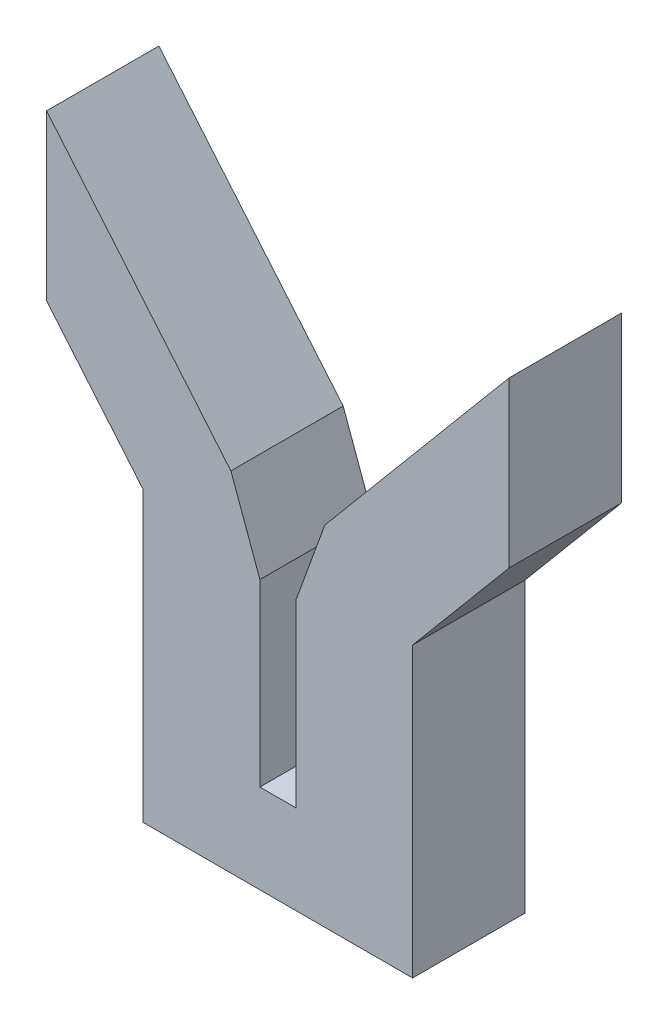
ISO-10303-21;
HEADER;
FILE_DESCRIPTION(('STEP AP214'),'2;1');
FILE_NAME('part.step','',(''),(''),'','','');
FILE_SCHEMA(('AUTOMOTIVE_DESIGN { 1 0 10303 214 1 1 1 1 }'));
ENDSEC;
DATA;
#1=APPLICATION_CONTEXT('core data for automotive mechanical design processes');
#2=APPLICATION_PROTOCOL_DEFINITION('international standard','automotive_design',2000,#1);
#3=PRODUCT_CONTEXT('',#1,'mechanical');
#4=PRODUCT('Part','Part','',(#3));
#5=PRODUCT_RELATED_PRODUCT_CATEGORY('part','',(#4));
#6=PRODUCT_DEFINITION_FORMATION('','',#4);
#7=PRODUCT_DEFINITION_CONTEXT('part definition',#1,'design');
#8=PRODUCT_DEFINITION('design','',#6,#7);
#9=PRODUCT_DEFINITION_SHAPE('','',#8);
#10=(LENGTH_UNIT() NAMED_UNIT(*) SI_UNIT(.MILLI.,.METRE.));
#11=(NAMED_UNIT(*) PLANE_ANGLE_UNIT() SI_UNIT($,.RADIAN.));
#12=(NAMED_UNIT(*) SI_UNIT($,.STERADIAN.) SOLID_ANGLE_UNIT());
#13=UNCERTAINTY_MEASURE_WITH_UNIT(LENGTH_MEASURE(1.E-05),#10,'distance_accuracy_value','');
#14=(GEOMETRIC_REPRESENTATION_CONTEXT(3) GLOBAL_UNCERTAINTY_ASSIGNED_CONTEXT((#13)) GLOBAL_UNIT_ASSIGNED_CONTEXT((#10,
#11,#12)) REPRESENTATION_CONTEXT('',''));
#15=CARTESIAN_POINT('',(0.,0.,0.));
#16=DIRECTION('',(0.,0.,1.));
#17=DIRECTION('',(1.,0.,0.));
#18=AXIS2_PLACEMENT_3D('',#15,#16,#17);
#19=CARTESIAN_POINT('',(15.,0.,12.5));
#20=DIRECTION('',(1.,0.,0.));
#21=DIRECTION('',(0.,0.,-1.));
#22=AXIS2_PLACEMENT_3D('',#19,#20,#21);
#23=PLANE('',#22);
#24=DIRECTION('',(0.,-1.,0.));
#25=VECTOR('',#24,1.);
#26=CARTESIAN_POINT('',(15.,0.,0.));
#27=LINE('',#26,#25);
#28=CARTESIAN_POINT('',(15.,32.1026160659914,0.));
#29=VERTEX_POINT('',#28);
#30=CARTESIAN_POINT('',(15.,0.,0.));
#31=VERTEX_POINT('',#30);
#32=EDGE_CURVE('E161',#29,#31,#27,.T.);
#33=ORIENTED_EDGE('',*,*,#32,.F.);
#34=DIRECTION('',(0.,0.,-1.));
#35=VECTOR('',#34,1.);
#36=CARTESIAN_POINT('',(15.,32.1026160659914,12.5));
#37=LINE('',#36,#35);
#38=CARTESIAN_POINT('',(15.,32.1026160659914,12.5));
#39=VERTEX_POINT('',#38);
#40=EDGE_CURVE('E11',#39,#29,#37,.T.);
#41=ORIENTED_EDGE('',*,*,#40,.F.);
#42=DIRECTION('',(0.,-1.,0.));
#43=VECTOR('',#42,1.);
#44=CARTESIAN_POINT('',(15.,0.,12.5));
#45=LINE('',#44,#43);
#46=CARTESIAN_POINT('',(15.,0.,12.5));
#47=VERTEX_POINT('',#46);
#48=EDGE_CURVE('E194',#39,#47,#45,.T.);
#49=ORIENTED_EDGE('',*,*,#48,.T.);
#50=DIRECTION('',(0.,0.,-1.));
#51=VECTOR('',#50,1.);
#52=CARTESIAN_POINT('',(15.,0.,12.5));
#53=LINE('',#52,#51);
#54=EDGE_CURVE('E102',#47,#31,#53,.T.);
#55=ORIENTED_EDGE('',*,*,#54,.T.);
#56=EDGE_LOOP('',(#33,#41,#49,#55));
#57=FACE_BOUND('',#56,.T.);
#58=ADVANCED_FACE('F33',(#57),#23,.T.);
#59=CARTESIAN_POINT('',(-7.00509126437934,5.87796949630391,12.5));
#60=DIRECTION('',(0.766044443118977,-0.64278760968654,0.));
#61=DIRECTION('',(0.64278760968654,0.766044443118977,0.));
#62=AXIS2_PLACEMENT_3D('',#59,#60,#61);
#63=PLANE('',#62);
#64=DIRECTION('',(-0.64278760968654,-0.766044443118977,0.));
#65=VECTOR('',#64,1.);
#66=CARTESIAN_POINT('',(-7.00509126437934,5.87796949630391,0.));
#67=LINE('',#66,#65);
#68=CARTESIAN_POINT('',(25.7454388794693,44.9085314546003,0.));
#69=VERTEX_POINT('',#68);
#70=EDGE_CURVE('E164',#69,#29,#67,.T.);
#71=ORIENTED_EDGE('',*,*,#70,.F.);
#72=DIRECTION('',(0.,0.,-1.));
#73=VECTOR('',#72,1.);
#74=CARTESIAN_POINT('',(25.7454388794693,44.9085314546003,12.5));
#75=LINE('',#74,#73);
#76=CARTESIAN_POINT('',(25.7454388794693,44.9085314546003,12.5));
#77=VERTEX_POINT('',#76);
#78=EDGE_CURVE('E41',#77,#69,#75,.T.);
#79=ORIENTED_EDGE('',*,*,#78,.F.);
#80=DIRECTION('',(-0.64278760968654,-0.766044443118977,0.));
#81=VECTOR('',#80,1.);
#82=CARTESIAN_POINT('',(-7.00509126437934,5.87796949630391,12.5));
#83=LINE('',#82,#81);
#84=EDGE_CURVE('E239',#77,#39,#83,.T.);
#85=ORIENTED_EDGE('',*,*,#84,.T.);
#86=ORIENTED_EDGE('',*,*,#40,.T.);
#87=EDGE_LOOP('',(#71,#79,#85,#86));
#88=FACE_BOUND('',#87,.T.);
#89=ADVANCED_FACE('F226',(#88),#63,.T.);
#90=CARTESIAN_POINT('',(25.7454388794693,0.,12.5));
#91=DIRECTION('',(1.,0.,0.));
#92=DIRECTION('',(0.,1.,0.));
#93=AXIS2_PLACEMENT_3D('',#90,#91,#92);
#94=PLANE('',#93);
#95=DIRECTION('',(0.,-1.,0.));
#96=VECTOR('',#95,1.);
#97=CARTESIAN_POINT('',(25.7454388794693,0.,0.));
#98=LINE('',#97,#96);
#99=CARTESIAN_POINT('',(25.7454388794693,63.2289091694793,0.));
#100=VERTEX_POINT('',#99);
#101=EDGE_CURVE('E167',#100,#69,#98,.T.);
#102=ORIENTED_EDGE('',*,*,#101,.F.);
#103=DIRECTION('',(0.,0.,-1.));
#104=VECTOR('',#103,1.);
#105=CARTESIAN_POINT('',(25.7454388794693,63.2289091694793,12.5));
#106=LINE('',#105,#104);
#107=CARTESIAN_POINT('',(25.7454388794693,63.2289091694793,12.5));
#108=VERTEX_POINT('',#107);
#109=EDGE_CURVE('E215',#108,#100,#106,.T.);
#110=ORIENTED_EDGE('',*,*,#109,.F.);
#111=DIRECTION('',(0.,-1.,0.));
#112=VECTOR('',#111,1.);
#113=CARTESIAN_POINT('',(25.7454388794693,0.,12.5));
#114=LINE('',#113,#112);
#115=EDGE_CURVE('E222',#108,#77,#114,.T.);
#116=ORIENTED_EDGE('',*,*,#115,.T.);
#117=ORIENTED_EDGE('',*,*,#78,.T.);
#118=EDGE_LOOP('',(#102,#110,#116,#117));
#119=FACE_BOUND('',#118,.T.);
#120=ADVANCED_FACE('F220',(#119),#94,.T.);
#121=CARTESIAN_POINT('',(-16.0261162702418,13.4475082515641,12.5));
#122=DIRECTION('',(-0.766044443118977,0.642787609686541,0.));
#123=DIRECTION('',(-0.642787609686541,-0.766044443118977,0.));
#124=AXIS2_PLACEMENT_3D('',#121,#122,#123);
#125=PLANE('',#124);
#126=DIRECTION('',(0.642787609686541,0.766044443118977,0.));
#127=VECTOR('',#126,1.);
#128=CARTESIAN_POINT('',(-16.0261162702418,13.4475082515641,0.));
#129=LINE('',#128,#127);
#130=CARTESIAN_POINT('',(5.22752196876619,38.7766079785995,0.));
#131=VERTEX_POINT('',#130);
#132=EDGE_CURVE('E170',#131,#100,#129,.T.);
#133=ORIENTED_EDGE('',*,*,#132,.F.);
#134=DIRECTION('',(0.,0.,-1.));
#135=VECTOR('',#134,1.);
#136=CARTESIAN_POINT('',(5.22752196876619,38.7766079785995,12.5));
#137=LINE('',#136,#135);
#138=CARTESIAN_POINT('',(5.22752196876619,38.7766079785995,12.5));
#139=VERTEX_POINT('',#138);
#140=EDGE_CURVE('E213',#139,#131,#137,.T.);
#141=ORIENTED_EDGE('',*,*,#140,.F.);
#142=DIRECTION('',(0.642787609686541,0.766044443118977,0.));
#143=VECTOR('',#142,1.);
#144=CARTESIAN_POINT('',(-16.0261162702418,13.4475082515641,12.5));
#145=LINE('',#144,#143);
#146=EDGE_CURVE('E236',#139,#108,#145,.T.);
#147=ORIENTED_EDGE('',*,*,#146,.T.);
#148=ORIENTED_EDGE('',*,*,#109,.T.);
#149=EDGE_LOOP('',(#133,#141,#147,#148));
#150=FACE_BOUND('',#149,.T.);
#151=ADVANCED_FACE('F233',(#150),#125,.T.);
#152=CARTESIAN_POINT('',(-7.84654351504704,2.85590828135163,12.5));
#153=DIRECTION('',(-0.939692620785908,0.34202014332567,0.));
#154=DIRECTION('',(-0.34202014332567,-0.939692620785908,0.));
#155=AXIS2_PLACEMENT_3D('',#152,#153,#154);
#156=PLANE('',#155);
#157=DIRECTION('',(0.34202014332567,0.939692620785908,0.));
#158=VECTOR('',#157,1.);
#159=CARTESIAN_POINT('',(-7.84654351504704,2.85590828135163,0.));
#160=LINE('',#159,#158);
#161=CARTESIAN_POINT('',(2.,29.9090642486206,0.));
#162=VERTEX_POINT('',#161);
#163=EDGE_CURVE('E173',#162,#131,#160,.T.);
#164=ORIENTED_EDGE('',*,*,#163,.F.);
#165=DIRECTION('',(0.,0.,-1.));
#166=VECTOR('',#165,1.);
#167=CARTESIAN_POINT('',(2.,29.9090642486206,12.5));
#168=LINE('',#167,#166);
#169=CARTESIAN_POINT('',(2.,29.9090642486206,12.5));
#170=VERTEX_POINT('',#169);
#171=EDGE_CURVE('E211',#170,#162,#168,.T.);
#172=ORIENTED_EDGE('',*,*,#171,.F.);
#173=DIRECTION('',(0.34202014332567,0.939692620785908,0.));
#174=VECTOR('',#173,1.);
#175=CARTESIAN_POINT('',(-7.84654351504704,2.85590828135163,12.5));
#176=LINE('',#175,#174);
#177=EDGE_CURVE('E241',#170,#139,#176,.T.);
#178=ORIENTED_EDGE('',*,*,#177,.T.);
#179=ORIENTED_EDGE('',*,*,#140,.T.);
#180=EDGE_LOOP('',(#164,#172,#178,#179));
#181=FACE_BOUND('',#180,.T.);
#182=ADVANCED_FACE('F282',(#181),#156,.T.);
#183=CARTESIAN_POINT('',(2.,0.,12.5));
#184=DIRECTION('',(1.,0.,0.));
#185=DIRECTION('',(0.,1.,0.));
#186=AXIS2_PLACEMENT_3D('',#183,#184,#185);
#187=PLANE('',#186);
#188=DIRECTION('',(0.,-1.,0.));
#189=VECTOR('',#188,1.);
#190=CARTESIAN_POINT('',(2.,0.,0.));
#191=LINE('',#190,#189);
#192=CARTESIAN_POINT('',(2.,9.90906424862065,0.));
#193=VERTEX_POINT('',#192);
#194=EDGE_CURVE('E176',#162,#193,#191,.T.);
#195=ORIENTED_EDGE('',*,*,#194,.T.);
#196=DIRECTION('',(0.,0.,-1.));
#197=VECTOR('',#196,1.);
#198=CARTESIAN_POINT('',(2.,9.90906424862065,12.5));
#199=LINE('',#198,#197);
#200=CARTESIAN_POINT('',(2.,9.90906424862065,12.5));
#201=VERTEX_POINT('',#200);
#202=EDGE_CURVE('E208',#201,#193,#199,.T.);
#203=ORIENTED_EDGE('',*,*,#202,.F.);
#204=DIRECTION('',(0.,-1.,0.));
#205=VECTOR('',#204,1.);
#206=CARTESIAN_POINT('',(2.,0.,12.5));
#207=LINE('',#206,#205);
#208=EDGE_CURVE('E247',#170,#201,#207,.T.);
#209=ORIENTED_EDGE('',*,*,#208,.F.);
#210=ORIENTED_EDGE('',*,*,#171,.T.);
#211=EDGE_LOOP('',(#195,#203,#209,#210));
#212=FACE_BOUND('',#211,.T.);
#213=ADVANCED_FACE('F285',(#212),#187,.F.);
#214=CARTESIAN_POINT('',(0.,9.90906424862064,12.5));
#215=DIRECTION('',(0.,-1.,0.));
#216=DIRECTION('',(1.,0.,0.));
#217=AXIS2_PLACEMENT_3D('',#214,#215,#216);
#218=PLANE('',#217);
#219=DIRECTION('',(-1.,0.,0.));
#220=VECTOR('',#219,1.);
#221=CARTESIAN_POINT('',(0.,9.90906424862064,0.));
#222=LINE('',#221,#220);
#223=CARTESIAN_POINT('',(-2.,9.90906424862064,0.));
#224=VERTEX_POINT('',#223);
#225=EDGE_CURVE('E178',#193,#224,#222,.T.);
#226=ORIENTED_EDGE('',*,*,#225,.T.);
#227=DIRECTION('',(0.,0.,-1.));
#228=VECTOR('',#227,1.);
#229=CARTESIAN_POINT('',(-2.,9.90906424862064,12.5));
#230=LINE('',#229,#228);
#231=CARTESIAN_POINT('',(-2.,9.90906424862064,12.5));
#232=VERTEX_POINT('',#231);
#233=EDGE_CURVE('E206',#232,#224,#230,.T.);
#234=ORIENTED_EDGE('',*,*,#233,.F.);
#235=DIRECTION('',(-1.,0.,0.));
#236=VECTOR('',#235,1.);
#237=CARTESIAN_POINT('',(0.,9.90906424862064,12.5));
#238=LINE('',#237,#236);
#239=EDGE_CURVE('E249',#201,#232,#238,.T.);
#240=ORIENTED_EDGE('',*,*,#239,.F.);
#241=ORIENTED_EDGE('',*,*,#202,.T.);
#242=EDGE_LOOP('',(#226,#234,#240,#241));
#243=FACE_BOUND('',#242,.T.);
#244=ADVANCED_FACE('F289',(#243),#218,.F.);
#245=CARTESIAN_POINT('',(-2.,0.,12.5));
#246=DIRECTION('',(1.,0.,0.));
#247=DIRECTION('',(0.,1.,0.));
#248=AXIS2_PLACEMENT_3D('',#245,#246,#247);
#249=PLANE('',#248);
#250=DIRECTION('',(0.,-1.,0.));
#251=VECTOR('',#250,1.);
#252=CARTESIAN_POINT('',(-2.,0.,0.));
#253=LINE('',#252,#251);
#254=CARTESIAN_POINT('',(-2.,29.9090642486206,0.));
#255=VERTEX_POINT('',#254);
#256=EDGE_CURVE('E181',#255,#224,#253,.T.);
#257=ORIENTED_EDGE('',*,*,#256,.F.);
#258=DIRECTION('',(0.,0.,-1.));
#259=VECTOR('',#258,1.);
#260=CARTESIAN_POINT('',(-2.,29.9090642486206,12.5));
#261=LINE('',#260,#259);
#262=CARTESIAN_POINT('',(-2.,29.9090642486206,12.5));
#263=VERTEX_POINT('',#262);
#264=EDGE_CURVE('E204',#263,#255,#261,.T.);
#265=ORIENTED_EDGE('',*,*,#264,.F.);
#266=DIRECTION('',(0.,-1.,0.));
#267=VECTOR('',#266,1.);
#268=CARTESIAN_POINT('',(-2.,0.,12.5));
#269=LINE('',#268,#267);
#270=EDGE_CURVE('E251',#263,#232,#269,.T.);
#271=ORIENTED_EDGE('',*,*,#270,.T.);
#272=ORIENTED_EDGE('',*,*,#233,.T.);
#273=EDGE_LOOP('',(#257,#265,#271,#272));
#274=FACE_BOUND('',#273,.T.);
#275=ADVANCED_FACE('F293',(#274),#249,.T.);
#276=CARTESIAN_POINT('',(7.84654351504705,2.85590828135164,12.5));
#277=DIRECTION('',(-0.939692620785908,-0.34202014332567,0.));
#278=DIRECTION('',(0.34202014332567,-0.939692620785908,0.));
#279=AXIS2_PLACEMENT_3D('',#276,#277,#278);
#280=PLANE('',#279);
#281=DIRECTION('',(-0.34202014332567,0.939692620785908,0.));
#282=VECTOR('',#281,1.);
#283=CARTESIAN_POINT('',(7.84654351504705,2.85590828135164,0.));
#284=LINE('',#283,#282);
#285=CARTESIAN_POINT('',(-5.22752196876618,38.7766079785994,0.));
#286=VERTEX_POINT('',#285);
#287=EDGE_CURVE('E184',#255,#286,#284,.T.);
#288=ORIENTED_EDGE('',*,*,#287,.T.);
#289=DIRECTION('',(0.,0.,-1.));
#290=VECTOR('',#289,1.);
#291=CARTESIAN_POINT('',(-5.22752196876618,38.7766079785994,12.5));
#292=LINE('',#291,#290);
#293=CARTESIAN_POINT('',(-5.22752196876618,38.7766079785994,12.5));
#294=VERTEX_POINT('',#293);
#295=EDGE_CURVE('E201',#294,#286,#292,.T.);
#296=ORIENTED_EDGE('',*,*,#295,.F.);
#297=DIRECTION('',(-0.34202014332567,0.939692620785908,0.));
#298=VECTOR('',#297,1.);
#299=CARTESIAN_POINT('',(7.84654351504705,2.85590828135164,12.5));
#300=LINE('',#299,#298);
#301=EDGE_CURVE('E254',#263,#294,#300,.T.);
#302=ORIENTED_EDGE('',*,*,#301,.F.);
#303=ORIENTED_EDGE('',*,*,#264,.T.);
#304=EDGE_LOOP('',(#288,#296,#302,#303));
#305=FACE_BOUND('',#304,.T.);
#306=ADVANCED_FACE('F297',(#305),#280,.F.);
#307=CARTESIAN_POINT('',(16.0261162702418,13.4475082515641,12.5));
#308=DIRECTION('',(-0.766044443118977,-0.642787609686541,0.));
#309=DIRECTION('',(0.642787609686541,-0.766044443118977,0.));
#310=AXIS2_PLACEMENT_3D('',#307,#308,#309);
#311=PLANE('',#310);
#312=DIRECTION('',(-0.642787609686541,0.766044443118977,0.));
#313=VECTOR('',#312,1.);
#314=CARTESIAN_POINT('',(16.0261162702418,13.4475082515641,0.));
#315=LINE('',#314,#313);
#316=CARTESIAN_POINT('',(-25.7454388794693,63.2289091694792,0.));
#317=VERTEX_POINT('',#316);
#318=EDGE_CURVE('E186',#286,#317,#315,.T.);
#319=ORIENTED_EDGE('',*,*,#318,.T.);
#320=DIRECTION('',(0.,0.,-1.));
#321=VECTOR('',#320,1.);
#322=CARTESIAN_POINT('',(-25.7454388794693,63.2289091694792,12.5));
#323=LINE('',#322,#321);
#324=CARTESIAN_POINT('',(-25.7454388794693,63.2289091694792,12.5));
#325=VERTEX_POINT('',#324);
#326=EDGE_CURVE('E198',#325,#317,#323,.T.);
#327=ORIENTED_EDGE('',*,*,#326,.F.);
#328=DIRECTION('',(-0.642787609686541,0.766044443118977,0.));
#329=VECTOR('',#328,1.);
#330=CARTESIAN_POINT('',(16.0261162702418,13.4475082515641,12.5));
#331=LINE('',#330,#329);
#332=EDGE_CURVE('E256',#294,#325,#331,.T.);
#333=ORIENTED_EDGE('',*,*,#332,.F.);
#334=ORIENTED_EDGE('',*,*,#295,.T.);
#335=EDGE_LOOP('',(#319,#327,#333,#334));
#336=FACE_BOUND('',#335,.T.);
#337=ADVANCED_FACE('F263',(#336),#311,.F.);
#338=CARTESIAN_POINT('',(-25.7454388794693,0.,12.5));
#339=DIRECTION('',(1.,0.,0.));
#340=DIRECTION('',(0.,1.,0.));
#341=AXIS2_PLACEMENT_3D('',#338,#339,#340);
#342=PLANE('',#341);
#343=DIRECTION('',(0.,-1.,0.));
#344=VECTOR('',#343,1.);
#345=CARTESIAN_POINT('',(-25.7454388794693,0.,0.));
#346=LINE('',#345,#344);
#347=CARTESIAN_POINT('',(-25.7454388794693,44.9085314546003,0.));
#348=VERTEX_POINT('',#347);
#349=EDGE_CURVE('E188',#317,#348,#346,.T.);
#350=ORIENTED_EDGE('',*,*,#349,.T.);
#351=DIRECTION('',(0.,0.,-1.));
#352=VECTOR('',#351,1.);
#353=CARTESIAN_POINT('',(-25.7454388794693,44.9085314546003,12.5));
#354=LINE('',#353,#352);
#355=CARTESIAN_POINT('',(-25.7454388794693,44.9085314546003,12.5));
#356=VERTEX_POINT('',#355);
#357=EDGE_CURVE('E153',#356,#348,#354,.T.);
#358=ORIENTED_EDGE('',*,*,#357,.F.);
#359=DIRECTION('',(0.,-1.,0.));
#360=VECTOR('',#359,1.);
#361=CARTESIAN_POINT('',(-25.7454388794693,0.,12.5));
#362=LINE('',#361,#360);
#363=EDGE_CURVE('E144',#325,#356,#362,.T.);
#364=ORIENTED_EDGE('',*,*,#363,.F.);
#365=ORIENTED_EDGE('',*,*,#326,.T.);
#366=EDGE_LOOP('',(#350,#358,#364,#365));
#367=FACE_BOUND('',#366,.T.);
#368=ADVANCED_FACE('F267',(#367),#342,.F.);
#369=CARTESIAN_POINT('',(7.00509126437933,5.8779694963039,12.5));
#370=DIRECTION('',(0.766044443118977,0.64278760968654,0.));
#371=DIRECTION('',(-0.64278760968654,0.766044443118977,0.));
#372=AXIS2_PLACEMENT_3D('',#369,#370,#371);
#373=PLANE('',#372);
#374=DIRECTION('',(0.64278760968654,-0.766044443118977,0.));
#375=VECTOR('',#374,1.);
#376=CARTESIAN_POINT('',(7.00509126437933,5.8779694963039,0.));
#377=LINE('',#376,#375);
#378=CARTESIAN_POINT('',(-15.,32.1026160659914,0.));
#379=VERTEX_POINT('',#378);
#380=EDGE_CURVE('E152',#348,#379,#377,.T.);
#381=ORIENTED_EDGE('',*,*,#380,.T.);
#382=DIRECTION('',(0.,0.,-1.));
#383=VECTOR('',#382,1.);
#384=CARTESIAN_POINT('',(-15.,32.1026160659914,12.5));
#385=LINE('',#384,#383);
#386=CARTESIAN_POINT('',(-15.,32.1026160659914,12.5));
#387=VERTEX_POINT('',#386);
#388=EDGE_CURVE('E149',#387,#379,#385,.T.);
#389=ORIENTED_EDGE('',*,*,#388,.F.);
#390=DIRECTION('',(0.64278760968654,-0.766044443118977,0.));
#391=VECTOR('',#390,1.);
#392=CARTESIAN_POINT('',(7.00509126437933,5.8779694963039,12.5));
#393=LINE('',#392,#391);
#394=EDGE_CURVE('E138',#356,#387,#393,.T.);
#395=ORIENTED_EDGE('',*,*,#394,.F.);
#396=ORIENTED_EDGE('',*,*,#357,.T.);
#397=EDGE_LOOP('',(#381,#389,#395,#396));
#398=FACE_BOUND('',#397,.T.);
#399=ADVANCED_FACE('F150',(#398),#373,.F.);
#400=CARTESIAN_POINT('',(-15.,0.,12.5));
#401=DIRECTION('',(1.,0.,0.));
#402=DIRECTION('',(0.,1.,0.));
#403=AXIS2_PLACEMENT_3D('',#400,#401,#402);
#404=PLANE('',#403);
#405=DIRECTION('',(0.,-1.,0.));
#406=VECTOR('',#405,1.);
#407=CARTESIAN_POINT('',(-15.,0.,0.));
#408=LINE('',#407,#406);
#409=CARTESIAN_POINT('',(-15.,0.,0.));
#410=VERTEX_POINT('',#409);
#411=EDGE_CURVE('E95',#379,#410,#408,.T.);
#412=ORIENTED_EDGE('',*,*,#411,.T.);
#413=DIRECTION('',(0.,0.,-1.));
#414=VECTOR('',#413,1.);
#415=CARTESIAN_POINT('',(-15.,0.,12.5));
#416=LINE('',#415,#414);
#417=CARTESIAN_POINT('',(-15.,0.,12.5));
#418=VERTEX_POINT('',#417);
#419=EDGE_CURVE('E154',#418,#410,#416,.T.);
#420=ORIENTED_EDGE('',*,*,#419,.F.);
#421=DIRECTION('',(0.,-1.,0.));
#422=VECTOR('',#421,1.);
#423=CARTESIAN_POINT('',(-15.,0.,12.5));
#424=LINE('',#423,#422);
#425=EDGE_CURVE('E142',#387,#418,#424,.T.);
#426=ORIENTED_EDGE('',*,*,#425,.F.);
#427=ORIENTED_EDGE('',*,*,#388,.T.);
#428=EDGE_LOOP('',(#412,#420,#426,#427));
#429=FACE_BOUND('',#428,.T.);
#430=ADVANCED_FACE('F156',(#429),#404,.F.);
#431=CARTESIAN_POINT('',(0.,0.,12.5));
#432=DIRECTION('',(0.,1.,0.));
#433=DIRECTION('',(0.,0.,1.));
#434=AXIS2_PLACEMENT_3D('',#431,#432,#433);
#435=PLANE('',#434);
#436=DIRECTION('',(1.,0.,0.));
#437=VECTOR('',#436,1.);
#438=CARTESIAN_POINT('',(0.,0.,0.));
#439=LINE('',#438,#437);
#440=EDGE_CURVE('E192',#410,#31,#439,.T.);
#441=ORIENTED_EDGE('',*,*,#440,.T.);
#442=ORIENTED_EDGE('',*,*,#54,.F.);
#443=DIRECTION('',(1.,0.,0.));
#444=VECTOR('',#443,1.);
#445=CARTESIAN_POINT('',(0.,0.,12.5));
#446=LINE('',#445,#444);
#447=EDGE_CURVE('E49',#418,#47,#446,.T.);
#448=ORIENTED_EDGE('',*,*,#447,.F.);
#449=ORIENTED_EDGE('',*,*,#419,.T.);
#450=EDGE_LOOP('',(#441,#442,#448,#449));
#451=FACE_BOUND('',#450,.T.);
#452=ADVANCED_FACE('F270',(#451),#435,.F.);
#453=CARTESIAN_POINT('',(0.,0.,12.5));
#454=DIRECTION('',(0.,0.,1.));
#455=DIRECTION('',(1.,0.,0.));
#456=AXIS2_PLACEMENT_3D('',#453,#454,#455);
#457=PLANE('',#456);
#458=ORIENTED_EDGE('',*,*,#48,.F.);
#459=ORIENTED_EDGE('',*,*,#84,.F.);
#460=ORIENTED_EDGE('',*,*,#115,.F.);
#461=ORIENTED_EDGE('',*,*,#146,.F.);
#462=ORIENTED_EDGE('',*,*,#177,.F.);
#463=ORIENTED_EDGE('',*,*,#208,.T.);
#464=ORIENTED_EDGE('',*,*,#239,.T.);
#465=ORIENTED_EDGE('',*,*,#270,.F.);
#466=ORIENTED_EDGE('',*,*,#301,.T.);
#467=ORIENTED_EDGE('',*,*,#332,.T.);
#468=ORIENTED_EDGE('',*,*,#363,.T.);
#469=ORIENTED_EDGE('',*,*,#394,.T.);
#470=ORIENTED_EDGE('',*,*,#425,.T.);
#471=ORIENTED_EDGE('',*,*,#447,.T.);
#472=EDGE_LOOP('',(#458,#459,#460,#461,#462,#463,#464,#465,#466,#467,#468,#469,#470,#471));
#473=FACE_BOUND('',#472,.T.);
#474=ADVANCED_FACE('F140',(#473),#457,.T.);
#475=CARTESIAN_POINT('',(0.,0.,0.));
#476=DIRECTION('',(0.,0.,1.));
#477=DIRECTION('',(1.,0.,0.));
#478=AXIS2_PLACEMENT_3D('',#475,#476,#477);
#479=PLANE('',#478);
#480=ORIENTED_EDGE('',*,*,#32,.T.);
#481=ORIENTED_EDGE('',*,*,#440,.F.);
#482=ORIENTED_EDGE('',*,*,#411,.F.);
#483=ORIENTED_EDGE('',*,*,#380,.F.);
#484=ORIENTED_EDGE('',*,*,#349,.F.);
#485=ORIENTED_EDGE('',*,*,#318,.F.);
#486=ORIENTED_EDGE('',*,*,#287,.F.);
#487=ORIENTED_EDGE('',*,*,#256,.T.);
#488=ORIENTED_EDGE('',*,*,#225,.F.);
#489=ORIENTED_EDGE('',*,*,#194,.F.);
#490=ORIENTED_EDGE('',*,*,#163,.T.);
#491=ORIENTED_EDGE('',*,*,#132,.T.);
#492=ORIENTED_EDGE('',*,*,#101,.T.);
#493=ORIENTED_EDGE('',*,*,#70,.T.);
#494=EDGE_LOOP('',(#480,#481,#482,#483,#484,#485,#486,#487,#488,#489,#490,#491,#492,#493));
#495=FACE_BOUND('',#494,.T.);
#496=ADVANCED_FACE('F228',(#495),#479,.F.);
#497=CLOSED_SHELL('',(#58,#89,#120,#151,#182,#213,#244,#275,#306,#337,#368,#399,#430,#452,#474,#496));
#498=MANIFOLD_SOLID_BREP('B2',#497);
#499=ADVANCED_BREP_SHAPE_REPRESENTATION('',(#18,#498),#14);
#500=SHAPE_DEFINITION_REPRESENTATION(#9,#499);
ENDSEC;
END-ISO-10303-21;
